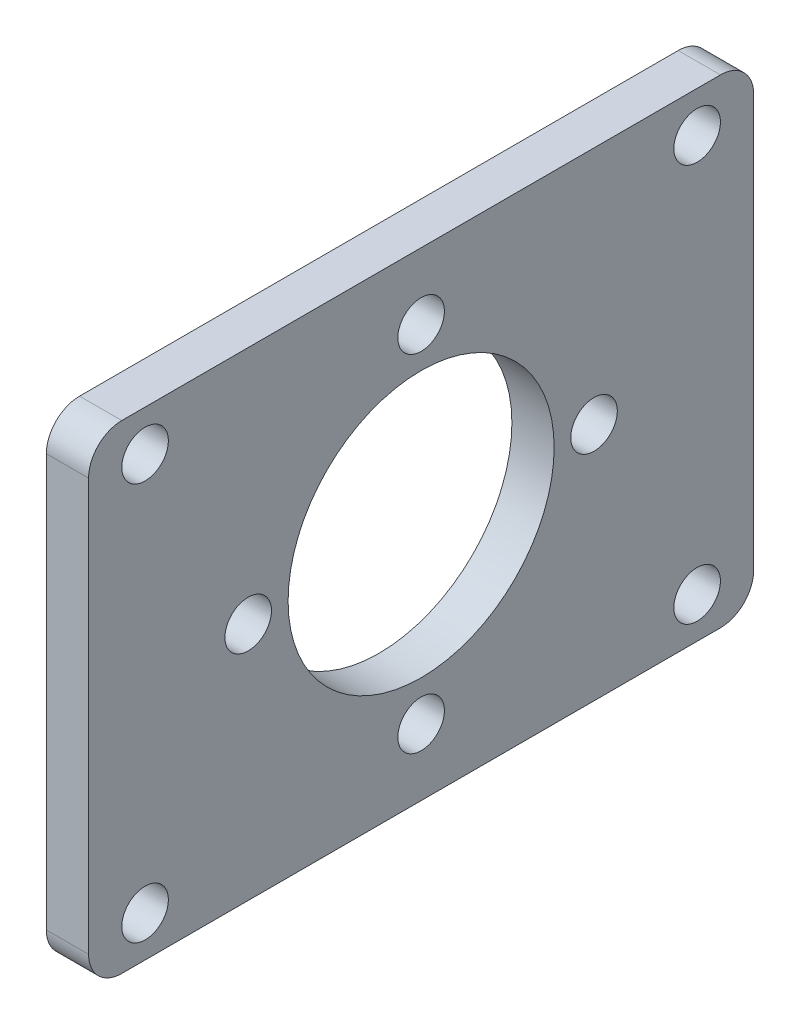
ISO-10303-21;
HEADER;
FILE_DESCRIPTION(('STEP AP214'),'2;1');
FILE_NAME('part.step','',(''),(''),'','','');
FILE_SCHEMA(('AUTOMOTIVE_DESIGN { 1 0 10303 214 1 1 1 1 }'));
ENDSEC;
DATA;
#1=APPLICATION_CONTEXT('core data for automotive mechanical design processes');
#2=APPLICATION_PROTOCOL_DEFINITION('international standard','automotive_design',2000,#1);
#3=PRODUCT_CONTEXT('',#1,'mechanical');
#4=PRODUCT('Part','Part','',(#3));
#5=PRODUCT_RELATED_PRODUCT_CATEGORY('part','',(#4));
#6=PRODUCT_DEFINITION_FORMATION('','',#4);
#7=PRODUCT_DEFINITION_CONTEXT('part definition',#1,'design');
#8=PRODUCT_DEFINITION('design','',#6,#7);
#9=PRODUCT_DEFINITION_SHAPE('','',#8);
#10=(LENGTH_UNIT() NAMED_UNIT(*) SI_UNIT(.MILLI.,.METRE.));
#11=(NAMED_UNIT(*) PLANE_ANGLE_UNIT() SI_UNIT($,.RADIAN.));
#12=(NAMED_UNIT(*) SI_UNIT($,.STERADIAN.) SOLID_ANGLE_UNIT());
#13=UNCERTAINTY_MEASURE_WITH_UNIT(LENGTH_MEASURE(1.E-05),#10,'distance_accuracy_value','');
#14=(GEOMETRIC_REPRESENTATION_CONTEXT(3) GLOBAL_UNCERTAINTY_ASSIGNED_CONTEXT((#13)) GLOBAL_UNIT_ASSIGNED_CONTEXT((#10,
#11,#12)) REPRESENTATION_CONTEXT('',''));
#15=CARTESIAN_POINT('',(0.,0.,0.));
#16=DIRECTION('',(0.,0.,1.));
#17=DIRECTION('',(1.,0.,0.));
#18=AXIS2_PLACEMENT_3D('',#15,#16,#17);
#19=CARTESIAN_POINT('',(3.175,-9.15,-16.9927524996676));
#20=DIRECTION('',(-1.,0.,0.));
#21=DIRECTION('',(0.,0.,1.));
#22=AXIS2_PLACEMENT_3D('',#19,#20,#21);
#23=PLANE('',#22);
#24=CARTESIAN_POINT('',(3.175,-9.15,-16.9927524996676));
#25=DIRECTION('',(1.,0.,0.));
#26=DIRECTION('',(0.,0.,1.));
#27=AXIS2_PLACEMENT_3D('',#24,#25,#26);
#28=CIRCLE('',#27,2.5);
#29=CARTESIAN_POINT('',(3.175,-9.15,-14.4927524996676));
#30=VERTEX_POINT('',#29);
#31=CARTESIAN_POINT('',(3.175,-11.65,-16.9927524996676));
#32=VERTEX_POINT('',#31);
#33=EDGE_CURVE('E151',#30,#32,#28,.T.);
#34=ORIENTED_EDGE('',*,*,#33,.T.);
#35=DIRECTION('',(0.,0.,-1.));
#36=VECTOR('',#35,1.);
#37=CARTESIAN_POINT('',(3.175,-11.65,-61.9927524996676));
#38=LINE('',#37,#36);
#39=CARTESIAN_POINT('',(3.175,-11.65,-61.9927524996676));
#40=VERTEX_POINT('',#39);
#41=EDGE_CURVE('E99',#32,#40,#38,.T.);
#42=ORIENTED_EDGE('',*,*,#41,.T.);
#43=CARTESIAN_POINT('',(3.175,-9.15,-61.9927524996676));
#44=DIRECTION('',(1.,0.,0.));
#45=DIRECTION('',(0.,0.,-1.));
#46=AXIS2_PLACEMENT_3D('',#43,#44,#45);
#47=CIRCLE('',#46,2.5);
#48=CARTESIAN_POINT('',(3.175,-9.15,-64.4927524996676));
#49=VERTEX_POINT('',#48);
#50=EDGE_CURVE('E166',#40,#49,#47,.T.);
#51=ORIENTED_EDGE('',*,*,#50,.T.);
#52=DIRECTION('',(0.,1.,0.));
#53=VECTOR('',#52,1.);
#54=CARTESIAN_POINT('',(3.175,-9.15,-64.4927524996676));
#55=LINE('',#54,#53);
#56=CARTESIAN_POINT('',(3.175,21.85,-64.4927524996676));
#57=VERTEX_POINT('',#56);
#58=EDGE_CURVE('E179',#49,#57,#55,.T.);
#59=ORIENTED_EDGE('',*,*,#58,.T.);
#60=CARTESIAN_POINT('',(3.175,21.85,-61.9927524996676));
#61=DIRECTION('',(1.,0.,0.));
#62=DIRECTION('',(0.,0.,-1.));
#63=AXIS2_PLACEMENT_3D('',#60,#61,#62);
#64=CIRCLE('',#63,2.5);
#65=CARTESIAN_POINT('',(3.175,24.35,-61.9927524996676));
#66=VERTEX_POINT('',#65);
#67=EDGE_CURVE('E118',#57,#66,#64,.T.);
#68=ORIENTED_EDGE('',*,*,#67,.T.);
#69=DIRECTION('',(0.,0.,1.));
#70=VECTOR('',#69,1.);
#71=CARTESIAN_POINT('',(3.175,24.35,-61.9927524996676));
#72=LINE('',#71,#70);
#73=CARTESIAN_POINT('',(3.175,24.35,-16.9927524996676));
#74=VERTEX_POINT('',#73);
#75=EDGE_CURVE('E112',#66,#74,#72,.T.);
#76=ORIENTED_EDGE('',*,*,#75,.T.);
#77=CARTESIAN_POINT('',(3.175,21.85,-16.9927524996676));
#78=DIRECTION('',(1.,0.,0.));
#79=DIRECTION('',(0.,0.,-1.));
#80=AXIS2_PLACEMENT_3D('',#77,#78,#79);
#81=CIRCLE('',#80,2.5);
#82=CARTESIAN_POINT('',(3.175,21.85,-14.4927524996676));
#83=VERTEX_POINT('',#82);
#84=EDGE_CURVE('E116',#74,#83,#81,.T.);
#85=ORIENTED_EDGE('',*,*,#84,.T.);
#86=DIRECTION('',(0.,-1.,0.));
#87=VECTOR('',#86,1.);
#88=CARTESIAN_POINT('',(3.175,-9.15,-14.4927524996676));
#89=LINE('',#88,#87);
#90=EDGE_CURVE('E56',#83,#30,#89,.T.);
#91=ORIENTED_EDGE('',*,*,#90,.T.);
#92=EDGE_LOOP('',(#34,#42,#51,#59,#68,#76,#85,#91));
#93=FACE_BOUND('',#92,.T.);
#94=CARTESIAN_POINT('',(3.175,21.29,-18.7427524996676));
#95=DIRECTION('',(1.,0.,0.));
#96=DIRECTION('',(0.,0.,-1.));
#97=AXIS2_PLACEMENT_3D('',#94,#95,#96);
#98=CIRCLE('',#97,1.75);
#99=CARTESIAN_POINT('',(3.175,21.29,-20.4927524996676));
#100=VERTEX_POINT('',#99);
#101=EDGE_CURVE('E140',#100,#100,#98,.T.);
#102=ORIENTED_EDGE('',*,*,#101,.F.);
#103=EDGE_LOOP('',(#102));
#104=FACE_BOUND('',#103,.T.);
#105=CARTESIAN_POINT('',(3.175,-8.59,-18.7427524996676));
#106=DIRECTION('',(1.,0.,0.));
#107=DIRECTION('',(0.,0.,-1.));
#108=AXIS2_PLACEMENT_3D('',#105,#106,#107);
#109=CIRCLE('',#108,1.75);
#110=CARTESIAN_POINT('',(3.175,-8.59,-20.4927524996676));
#111=VERTEX_POINT('',#110);
#112=EDGE_CURVE('E188',#111,#111,#109,.T.);
#113=ORIENTED_EDGE('',*,*,#112,.F.);
#114=EDGE_LOOP('',(#113));
#115=FACE_BOUND('',#114,.T.);
#116=CARTESIAN_POINT('',(3.175,21.29,-60.2427524996676));
#117=DIRECTION('',(1.,0.,0.));
#118=DIRECTION('',(0.,0.,-1.));
#119=AXIS2_PLACEMENT_3D('',#116,#117,#118);
#120=CIRCLE('',#119,1.75);
#121=CARTESIAN_POINT('',(3.175,21.29,-61.9927524996676));
#122=VERTEX_POINT('',#121);
#123=EDGE_CURVE('E194',#122,#122,#120,.T.);
#124=ORIENTED_EDGE('',*,*,#123,.F.);
#125=EDGE_LOOP('',(#124));
#126=FACE_BOUND('',#125,.T.);
#127=CARTESIAN_POINT('',(3.175,-8.59,-60.2427524996676));
#128=DIRECTION('',(1.,0.,0.));
#129=DIRECTION('',(0.,0.,-1.));
#130=AXIS2_PLACEMENT_3D('',#127,#128,#129);
#131=CIRCLE('',#130,1.75);
#132=CARTESIAN_POINT('',(3.175,-8.59,-61.9927524996676));
#133=VERTEX_POINT('',#132);
#134=EDGE_CURVE('E200',#133,#133,#131,.T.);
#135=ORIENTED_EDGE('',*,*,#134,.F.);
#136=EDGE_LOOP('',(#135));
#137=FACE_BOUND('',#136,.T.);
#138=CARTESIAN_POINT('',(3.175,6.35,-39.4927524996676));
#139=DIRECTION('',(1.,0.,0.));
#140=DIRECTION('',(0.,0.,-1.));
#141=AXIS2_PLACEMENT_3D('',#138,#139,#140);
#142=CIRCLE('',#141,10.);
#143=CARTESIAN_POINT('',(3.175,6.35,-49.4927524996676));
#144=VERTEX_POINT('',#143);
#145=EDGE_CURVE('E206',#144,#144,#142,.T.);
#146=ORIENTED_EDGE('',*,*,#145,.F.);
#147=EDGE_LOOP('',(#146));
#148=FACE_BOUND('',#147,.T.);
#149=CARTESIAN_POINT('',(3.175,6.35,-26.4927524996676));
#150=DIRECTION('',(1.,0.,0.));
#151=DIRECTION('',(0.,0.,-1.));
#152=AXIS2_PLACEMENT_3D('',#149,#150,#151);
#153=CIRCLE('',#152,1.75);
#154=CARTESIAN_POINT('',(3.175,6.35,-28.2427524996676));
#155=VERTEX_POINT('',#154);
#156=EDGE_CURVE('E212',#155,#155,#153,.T.);
#157=ORIENTED_EDGE('',*,*,#156,.F.);
#158=EDGE_LOOP('',(#157));
#159=FACE_BOUND('',#158,.T.);
#160=CARTESIAN_POINT('',(3.175,19.35,-39.4927524996676));
#161=DIRECTION('',(1.,0.,0.));
#162=DIRECTION('',(0.,0.,-1.));
#163=AXIS2_PLACEMENT_3D('',#160,#161,#162);
#164=CIRCLE('',#163,1.75);
#165=CARTESIAN_POINT('',(3.175,19.35,-41.2427524996676));
#166=VERTEX_POINT('',#165);
#167=EDGE_CURVE('E218',#166,#166,#164,.T.);
#168=ORIENTED_EDGE('',*,*,#167,.F.);
#169=EDGE_LOOP('',(#168));
#170=FACE_BOUND('',#169,.T.);
#171=CARTESIAN_POINT('',(3.175,6.35000000000002,-52.4927524996676));
#172=DIRECTION('',(1.,0.,0.));
#173=DIRECTION('',(0.,0.,-1.));
#174=AXIS2_PLACEMENT_3D('',#171,#172,#173);
#175=CIRCLE('',#174,1.75);
#176=CARTESIAN_POINT('',(3.175,6.35000000000002,-54.2427524996676));
#177=VERTEX_POINT('',#176);
#178=EDGE_CURVE('E224',#177,#177,#175,.T.);
#179=ORIENTED_EDGE('',*,*,#178,.F.);
#180=EDGE_LOOP('',(#179));
#181=FACE_BOUND('',#180,.T.);
#182=CARTESIAN_POINT('',(3.175,-6.65,-39.4927524996676));
#183=DIRECTION('',(1.,0.,0.));
#184=DIRECTION('',(0.,0.,-1.));
#185=AXIS2_PLACEMENT_3D('',#182,#183,#184);
#186=CIRCLE('',#185,1.75);
#187=CARTESIAN_POINT('',(3.175,-6.65,-41.2427524996676));
#188=VERTEX_POINT('',#187);
#189=EDGE_CURVE('E230',#188,#188,#186,.T.);
#190=ORIENTED_EDGE('',*,*,#189,.F.);
#191=EDGE_LOOP('',(#190));
#192=FACE_BOUND('',#191,.T.);
#193=ADVANCED_FACE('F39',(#93,#104,#115,#126,#137,#148,#159,#170,#181,#192),#23,.F.);
#194=CARTESIAN_POINT('',(0.,-9.15,-16.9927524996676));
#195=DIRECTION('',(-1.,0.,0.));
#196=DIRECTION('',(0.,0.,1.));
#197=AXIS2_PLACEMENT_3D('',#194,#195,#196);
#198=PLANE('',#197);
#199=CARTESIAN_POINT('',(0.,6.35000000000002,-52.4927524996676));
#200=DIRECTION('',(1.,0.,0.));
#201=DIRECTION('',(0.,0.,-1.));
#202=AXIS2_PLACEMENT_3D('',#199,#200,#201);
#203=CIRCLE('',#202,1.75);
#204=CARTESIAN_POINT('',(0.,6.35000000000002,-54.2427524996676));
#205=VERTEX_POINT('',#204);
#206=EDGE_CURVE('E227',#205,#205,#203,.T.);
#207=ORIENTED_EDGE('',*,*,#206,.T.);
#208=EDGE_LOOP('',(#207));
#209=FACE_BOUND('',#208,.T.);
#210=CARTESIAN_POINT('',(0.,6.35,-26.4927524996676));
#211=DIRECTION('',(1.,0.,0.));
#212=DIRECTION('',(0.,0.,-1.));
#213=AXIS2_PLACEMENT_3D('',#210,#211,#212);
#214=CIRCLE('',#213,1.75);
#215=CARTESIAN_POINT('',(0.,6.35,-28.2427524996676));
#216=VERTEX_POINT('',#215);
#217=EDGE_CURVE('E215',#216,#216,#214,.T.);
#218=ORIENTED_EDGE('',*,*,#217,.T.);
#219=EDGE_LOOP('',(#218));
#220=FACE_BOUND('',#219,.T.);
#221=CARTESIAN_POINT('',(0.,-8.59,-60.2427524996676));
#222=DIRECTION('',(1.,0.,0.));
#223=DIRECTION('',(0.,0.,-1.));
#224=AXIS2_PLACEMENT_3D('',#221,#222,#223);
#225=CIRCLE('',#224,1.75);
#226=CARTESIAN_POINT('',(0.,-8.59,-61.9927524996676));
#227=VERTEX_POINT('',#226);
#228=EDGE_CURVE('E203',#227,#227,#225,.T.);
#229=ORIENTED_EDGE('',*,*,#228,.T.);
#230=EDGE_LOOP('',(#229));
#231=FACE_BOUND('',#230,.T.);
#232=CARTESIAN_POINT('',(0.,-8.59,-18.7427524996676));
#233=DIRECTION('',(1.,0.,0.));
#234=DIRECTION('',(0.,0.,-1.));
#235=AXIS2_PLACEMENT_3D('',#232,#233,#234);
#236=CIRCLE('',#235,1.75);
#237=CARTESIAN_POINT('',(0.,-8.59,-20.4927524996676));
#238=VERTEX_POINT('',#237);
#239=EDGE_CURVE('E191',#238,#238,#236,.T.);
#240=ORIENTED_EDGE('',*,*,#239,.T.);
#241=EDGE_LOOP('',(#240));
#242=FACE_BOUND('',#241,.T.);
#243=CARTESIAN_POINT('',(0.,-9.15,-16.9927524996676));
#244=DIRECTION('',(1.,0.,0.));
#245=DIRECTION('',(0.,0.,1.));
#246=AXIS2_PLACEMENT_3D('',#243,#244,#245);
#247=CIRCLE('',#246,2.5);
#248=CARTESIAN_POINT('',(0.,-9.15,-14.4927524996676));
#249=VERTEX_POINT('',#248);
#250=CARTESIAN_POINT('',(0.,-11.65,-16.9927524996676));
#251=VERTEX_POINT('',#250);
#252=EDGE_CURVE('E136',#249,#251,#247,.T.);
#253=ORIENTED_EDGE('',*,*,#252,.F.);
#254=DIRECTION('',(0.,-1.,0.));
#255=VECTOR('',#254,1.);
#256=CARTESIAN_POINT('',(0.,-9.15,-14.4927524996676));
#257=LINE('',#256,#255);
#258=CARTESIAN_POINT('',(0.,21.85,-14.4927524996676));
#259=VERTEX_POINT('',#258);
#260=EDGE_CURVE('E91',#259,#249,#257,.T.);
#261=ORIENTED_EDGE('',*,*,#260,.F.);
#262=CARTESIAN_POINT('',(0.,21.85,-16.9927524996676));
#263=DIRECTION('',(1.,0.,0.));
#264=DIRECTION('',(0.,0.,-1.));
#265=AXIS2_PLACEMENT_3D('',#262,#263,#264);
#266=CIRCLE('',#265,2.5);
#267=CARTESIAN_POINT('',(0.,24.35,-16.9927524996676));
#268=VERTEX_POINT('',#267);
#269=EDGE_CURVE('E85',#268,#259,#266,.T.);
#270=ORIENTED_EDGE('',*,*,#269,.F.);
#271=DIRECTION('',(0.,0.,1.));
#272=VECTOR('',#271,1.);
#273=CARTESIAN_POINT('',(0.,24.35,-61.9927524996676));
#274=LINE('',#273,#272);
#275=CARTESIAN_POINT('',(0.,24.35,-61.9927524996676));
#276=VERTEX_POINT('',#275);
#277=EDGE_CURVE('E126',#276,#268,#274,.T.);
#278=ORIENTED_EDGE('',*,*,#277,.F.);
#279=CARTESIAN_POINT('',(0.,21.85,-61.9927524996676));
#280=DIRECTION('',(1.,0.,0.));
#281=DIRECTION('',(0.,0.,-1.));
#282=AXIS2_PLACEMENT_3D('',#279,#280,#281);
#283=CIRCLE('',#282,2.5);
#284=CARTESIAN_POINT('',(0.,21.85,-64.4927524996676));
#285=VERTEX_POINT('',#284);
#286=EDGE_CURVE('E146',#285,#276,#283,.T.);
#287=ORIENTED_EDGE('',*,*,#286,.F.);
#288=DIRECTION('',(0.,1.,0.));
#289=VECTOR('',#288,1.);
#290=CARTESIAN_POINT('',(0.,-9.15,-64.4927524996676));
#291=LINE('',#290,#289);
#292=CARTESIAN_POINT('',(0.,-9.15,-64.4927524996676));
#293=VERTEX_POINT('',#292);
#294=EDGE_CURVE('E144',#293,#285,#291,.T.);
#295=ORIENTED_EDGE('',*,*,#294,.F.);
#296=CARTESIAN_POINT('',(0.,-9.15,-61.9927524996676));
#297=DIRECTION('',(1.,0.,0.));
#298=DIRECTION('',(0.,0.,-1.));
#299=AXIS2_PLACEMENT_3D('',#296,#297,#298);
#300=CIRCLE('',#299,2.5);
#301=CARTESIAN_POINT('',(0.,-11.65,-61.9927524996676));
#302=VERTEX_POINT('',#301);
#303=EDGE_CURVE('E142',#302,#293,#300,.T.);
#304=ORIENTED_EDGE('',*,*,#303,.F.);
#305=DIRECTION('',(0.,0.,-1.));
#306=VECTOR('',#305,1.);
#307=CARTESIAN_POINT('',(0.,-11.65,-61.9927524996676));
#308=LINE('',#307,#306);
#309=EDGE_CURVE('E139',#251,#302,#308,.T.);
#310=ORIENTED_EDGE('',*,*,#309,.F.);
#311=EDGE_LOOP('',(#253,#261,#270,#278,#287,#295,#304,#310));
#312=FACE_BOUND('',#311,.T.);
#313=CARTESIAN_POINT('',(0.,21.29,-18.7427524996676));
#314=DIRECTION('',(1.,0.,0.));
#315=DIRECTION('',(0.,0.,-1.));
#316=AXIS2_PLACEMENT_3D('',#313,#314,#315);
#317=CIRCLE('',#316,1.75);
#318=CARTESIAN_POINT('',(0.,21.29,-20.4927524996676));
#319=VERTEX_POINT('',#318);
#320=EDGE_CURVE('E185',#319,#319,#317,.T.);
#321=ORIENTED_EDGE('',*,*,#320,.T.);
#322=EDGE_LOOP('',(#321));
#323=FACE_BOUND('',#322,.T.);
#324=CARTESIAN_POINT('',(0.,21.29,-60.2427524996676));
#325=DIRECTION('',(1.,0.,0.));
#326=DIRECTION('',(0.,0.,-1.));
#327=AXIS2_PLACEMENT_3D('',#324,#325,#326);
#328=CIRCLE('',#327,1.75);
#329=CARTESIAN_POINT('',(0.,21.29,-61.9927524996676));
#330=VERTEX_POINT('',#329);
#331=EDGE_CURVE('E197',#330,#330,#328,.T.);
#332=ORIENTED_EDGE('',*,*,#331,.T.);
#333=EDGE_LOOP('',(#332));
#334=FACE_BOUND('',#333,.T.);
#335=CARTESIAN_POINT('',(0.,6.35,-39.4927524996676));
#336=DIRECTION('',(1.,0.,0.));
#337=DIRECTION('',(0.,0.,-1.));
#338=AXIS2_PLACEMENT_3D('',#335,#336,#337);
#339=CIRCLE('',#338,10.);
#340=CARTESIAN_POINT('',(0.,6.35,-49.4927524996676));
#341=VERTEX_POINT('',#340);
#342=EDGE_CURVE('E209',#341,#341,#339,.T.);
#343=ORIENTED_EDGE('',*,*,#342,.T.);
#344=EDGE_LOOP('',(#343));
#345=FACE_BOUND('',#344,.T.);
#346=CARTESIAN_POINT('',(0.,19.35,-39.4927524996676));
#347=DIRECTION('',(1.,0.,0.));
#348=DIRECTION('',(0.,0.,-1.));
#349=AXIS2_PLACEMENT_3D('',#346,#347,#348);
#350=CIRCLE('',#349,1.75);
#351=CARTESIAN_POINT('',(0.,19.35,-41.2427524996676));
#352=VERTEX_POINT('',#351);
#353=EDGE_CURVE('E221',#352,#352,#350,.T.);
#354=ORIENTED_EDGE('',*,*,#353,.T.);
#355=EDGE_LOOP('',(#354));
#356=FACE_BOUND('',#355,.T.);
#357=CARTESIAN_POINT('',(0.,-6.65,-39.4927524996676));
#358=DIRECTION('',(1.,0.,0.));
#359=DIRECTION('',(0.,0.,-1.));
#360=AXIS2_PLACEMENT_3D('',#357,#358,#359);
#361=CIRCLE('',#360,1.75);
#362=CARTESIAN_POINT('',(0.,-6.65,-41.2427524996676));
#363=VERTEX_POINT('',#362);
#364=EDGE_CURVE('E233',#363,#363,#361,.T.);
#365=ORIENTED_EDGE('',*,*,#364,.T.);
#366=EDGE_LOOP('',(#365));
#367=FACE_BOUND('',#366,.T.);
#368=ADVANCED_FACE('F170',(#209,#220,#231,#242,#312,#323,#334,#345,#356,#367),#198,.T.);
#369=CARTESIAN_POINT('',(3.175,-9.15,-16.9927524996676));
#370=DIRECTION('',(-1.,0.,0.));
#371=DIRECTION('',(0.,0.,1.));
#372=AXIS2_PLACEMENT_3D('',#369,#370,#371);
#373=CYLINDRICAL_SURFACE('',#372,2.5);
#374=ORIENTED_EDGE('',*,*,#252,.T.);
#375=DIRECTION('',(-1.,0.,0.));
#376=VECTOR('',#375,1.);
#377=CARTESIAN_POINT('',(3.175,-11.65,-16.9927524996676));
#378=LINE('',#377,#376);
#379=EDGE_CURVE('E11',#32,#251,#378,.T.);
#380=ORIENTED_EDGE('',*,*,#379,.F.);
#381=ORIENTED_EDGE('',*,*,#33,.F.);
#382=DIRECTION('',(-1.,0.,0.));
#383=VECTOR('',#382,1.);
#384=CARTESIAN_POINT('',(3.175,-9.15,-14.4927524996676));
#385=LINE('',#384,#383);
#386=EDGE_CURVE('E132',#30,#249,#385,.T.);
#387=ORIENTED_EDGE('',*,*,#386,.T.);
#388=EDGE_LOOP('',(#374,#380,#381,#387));
#389=FACE_BOUND('',#388,.T.);
#390=ADVANCED_FACE('F41',(#389),#373,.T.);
#391=CARTESIAN_POINT('',(3.175,-11.65,-61.9927524996676));
#392=DIRECTION('',(0.,1.,0.));
#393=DIRECTION('',(0.,0.,1.));
#394=AXIS2_PLACEMENT_3D('',#391,#392,#393);
#395=PLANE('',#394);
#396=ORIENTED_EDGE('',*,*,#309,.T.);
#397=DIRECTION('',(-1.,0.,0.));
#398=VECTOR('',#397,1.);
#399=CARTESIAN_POINT('',(3.175,-11.65,-61.9927524996676));
#400=LINE('',#399,#398);
#401=EDGE_CURVE('E48',#40,#302,#400,.T.);
#402=ORIENTED_EDGE('',*,*,#401,.F.);
#403=ORIENTED_EDGE('',*,*,#41,.F.);
#404=ORIENTED_EDGE('',*,*,#379,.T.);
#405=EDGE_LOOP('',(#396,#402,#403,#404));
#406=FACE_BOUND('',#405,.T.);
#407=ADVANCED_FACE('F265',(#406),#395,.F.);
#408=CARTESIAN_POINT('',(3.175,-9.15,-61.9927524996676));
#409=DIRECTION('',(-1.,0.,0.));
#410=DIRECTION('',(0.,0.,1.));
#411=AXIS2_PLACEMENT_3D('',#408,#409,#410);
#412=CYLINDRICAL_SURFACE('',#411,2.5);
#413=ORIENTED_EDGE('',*,*,#303,.T.);
#414=DIRECTION('',(-1.,0.,0.));
#415=VECTOR('',#414,1.);
#416=CARTESIAN_POINT('',(3.175,-9.15,-64.4927524996676));
#417=LINE('',#416,#415);
#418=EDGE_CURVE('E158',#49,#293,#417,.T.);
#419=ORIENTED_EDGE('',*,*,#418,.F.);
#420=ORIENTED_EDGE('',*,*,#50,.F.);
#421=ORIENTED_EDGE('',*,*,#401,.T.);
#422=EDGE_LOOP('',(#413,#419,#420,#421));
#423=FACE_BOUND('',#422,.T.);
#424=ADVANCED_FACE('F164',(#423),#412,.T.);
#425=CARTESIAN_POINT('',(3.175,-9.15,-64.4927524996676));
#426=DIRECTION('',(0.,0.,1.));
#427=DIRECTION('',(1.,0.,0.));
#428=AXIS2_PLACEMENT_3D('',#425,#426,#427);
#429=PLANE('',#428);
#430=ORIENTED_EDGE('',*,*,#294,.T.);
#431=DIRECTION('',(-1.,0.,0.));
#432=VECTOR('',#431,1.);
#433=CARTESIAN_POINT('',(3.175,21.85,-64.4927524996676));
#434=LINE('',#433,#432);
#435=EDGE_CURVE('E155',#57,#285,#434,.T.);
#436=ORIENTED_EDGE('',*,*,#435,.F.);
#437=ORIENTED_EDGE('',*,*,#58,.F.);
#438=ORIENTED_EDGE('',*,*,#418,.T.);
#439=EDGE_LOOP('',(#430,#436,#437,#438));
#440=FACE_BOUND('',#439,.T.);
#441=ADVANCED_FACE('F175',(#440),#429,.F.);
#442=CARTESIAN_POINT('',(3.175,21.85,-61.9927524996676));
#443=DIRECTION('',(-1.,0.,0.));
#444=DIRECTION('',(0.,0.,1.));
#445=AXIS2_PLACEMENT_3D('',#442,#443,#444);
#446=CYLINDRICAL_SURFACE('',#445,2.5);
#447=ORIENTED_EDGE('',*,*,#286,.T.);
#448=DIRECTION('',(-1.,0.,0.));
#449=VECTOR('',#448,1.);
#450=CARTESIAN_POINT('',(3.175,24.35,-61.9927524996676));
#451=LINE('',#450,#449);
#452=EDGE_CURVE('E127',#66,#276,#451,.T.);
#453=ORIENTED_EDGE('',*,*,#452,.F.);
#454=ORIENTED_EDGE('',*,*,#67,.F.);
#455=ORIENTED_EDGE('',*,*,#435,.T.);
#456=EDGE_LOOP('',(#447,#453,#454,#455));
#457=FACE_BOUND('',#456,.T.);
#458=ADVANCED_FACE('F178',(#457),#446,.T.);
#459=CARTESIAN_POINT('',(3.175,24.35,-61.9927524996676));
#460=DIRECTION('',(0.,-1.,0.));
#461=DIRECTION('',(0.,0.,-1.));
#462=AXIS2_PLACEMENT_3D('',#459,#460,#461);
#463=PLANE('',#462);
#464=ORIENTED_EDGE('',*,*,#277,.T.);
#465=DIRECTION('',(-1.,0.,0.));
#466=VECTOR('',#465,1.);
#467=CARTESIAN_POINT('',(3.175,24.35,-16.9927524996676));
#468=LINE('',#467,#466);
#469=EDGE_CURVE('E123',#74,#268,#468,.T.);
#470=ORIENTED_EDGE('',*,*,#469,.F.);
#471=ORIENTED_EDGE('',*,*,#75,.F.);
#472=ORIENTED_EDGE('',*,*,#452,.T.);
#473=EDGE_LOOP('',(#464,#470,#471,#472));
#474=FACE_BOUND('',#473,.T.);
#475=ADVANCED_FACE('F124',(#474),#463,.F.);
#476=CARTESIAN_POINT('',(3.175,21.85,-16.9927524996676));
#477=DIRECTION('',(-1.,0.,0.));
#478=DIRECTION('',(0.,0.,1.));
#479=AXIS2_PLACEMENT_3D('',#476,#477,#478);
#480=CYLINDRICAL_SURFACE('',#479,2.5);
#481=ORIENTED_EDGE('',*,*,#269,.T.);
#482=DIRECTION('',(-1.,0.,0.));
#483=VECTOR('',#482,1.);
#484=CARTESIAN_POINT('',(3.175,21.85,-14.4927524996676));
#485=LINE('',#484,#483);
#486=EDGE_CURVE('E128',#83,#259,#485,.T.);
#487=ORIENTED_EDGE('',*,*,#486,.F.);
#488=ORIENTED_EDGE('',*,*,#84,.F.);
#489=ORIENTED_EDGE('',*,*,#469,.T.);
#490=EDGE_LOOP('',(#481,#487,#488,#489));
#491=FACE_BOUND('',#490,.T.);
#492=ADVANCED_FACE('F130',(#491),#480,.T.);
#493=CARTESIAN_POINT('',(3.175,-9.15,-14.4927524996676));
#494=DIRECTION('',(0.,0.,-1.));
#495=DIRECTION('',(0.,1.,0.));
#496=AXIS2_PLACEMENT_3D('',#493,#494,#495);
#497=PLANE('',#496);
#498=ORIENTED_EDGE('',*,*,#260,.T.);
#499=ORIENTED_EDGE('',*,*,#386,.F.);
#500=ORIENTED_EDGE('',*,*,#90,.F.);
#501=ORIENTED_EDGE('',*,*,#486,.T.);
#502=EDGE_LOOP('',(#498,#499,#500,#501));
#503=FACE_BOUND('',#502,.T.);
#504=ADVANCED_FACE('F253',(#503),#497,.F.);
#505=CARTESIAN_POINT('',(3.175,21.29,-18.7427524996676));
#506=DIRECTION('',(-1.,0.,0.));
#507=DIRECTION('',(0.,0.,1.));
#508=AXIS2_PLACEMENT_3D('',#505,#506,#507);
#509=CYLINDRICAL_SURFACE('',#508,1.75);
#510=ORIENTED_EDGE('',*,*,#101,.T.);
#511=EDGE_LOOP('',(#510));
#512=FACE_BOUND('',#511,.T.);
#513=ORIENTED_EDGE('',*,*,#320,.F.);
#514=EDGE_LOOP('',(#513));
#515=FACE_BOUND('',#514,.T.);
#516=ADVANCED_FACE('F250',(#512,#515),#509,.F.);
#517=CARTESIAN_POINT('',(3.175,-8.59,-18.7427524996676));
#518=DIRECTION('',(-1.,0.,0.));
#519=DIRECTION('',(0.,0.,1.));
#520=AXIS2_PLACEMENT_3D('',#517,#518,#519);
#521=CYLINDRICAL_SURFACE('',#520,1.75);
#522=ORIENTED_EDGE('',*,*,#112,.T.);
#523=EDGE_LOOP('',(#522));
#524=FACE_BOUND('',#523,.T.);
#525=ORIENTED_EDGE('',*,*,#239,.F.);
#526=EDGE_LOOP('',(#525));
#527=FACE_BOUND('',#526,.T.);
#528=ADVANCED_FACE('F328',(#524,#527),#521,.F.);
#529=CARTESIAN_POINT('',(3.175,21.29,-60.2427524996676));
#530=DIRECTION('',(-1.,0.,0.));
#531=DIRECTION('',(0.,0.,1.));
#532=AXIS2_PLACEMENT_3D('',#529,#530,#531);
#533=CYLINDRICAL_SURFACE('',#532,1.75);
#534=ORIENTED_EDGE('',*,*,#123,.T.);
#535=EDGE_LOOP('',(#534));
#536=FACE_BOUND('',#535,.T.);
#537=ORIENTED_EDGE('',*,*,#331,.F.);
#538=EDGE_LOOP('',(#537));
#539=FACE_BOUND('',#538,.T.);
#540=ADVANCED_FACE('F336',(#536,#539),#533,.F.);
#541=CARTESIAN_POINT('',(3.175,-8.59,-60.2427524996676));
#542=DIRECTION('',(-1.,0.,0.));
#543=DIRECTION('',(0.,0.,1.));
#544=AXIS2_PLACEMENT_3D('',#541,#542,#543);
#545=CYLINDRICAL_SURFACE('',#544,1.75);
#546=ORIENTED_EDGE('',*,*,#134,.T.);
#547=EDGE_LOOP('',(#546));
#548=FACE_BOUND('',#547,.T.);
#549=ORIENTED_EDGE('',*,*,#228,.F.);
#550=EDGE_LOOP('',(#549));
#551=FACE_BOUND('',#550,.T.);
#552=ADVANCED_FACE('F344',(#548,#551),#545,.F.);
#553=CARTESIAN_POINT('',(3.175,6.35,-39.4927524996676));
#554=DIRECTION('',(-1.,0.,0.));
#555=DIRECTION('',(0.,0.,1.));
#556=AXIS2_PLACEMENT_3D('',#553,#554,#555);
#557=CYLINDRICAL_SURFACE('',#556,10.);
#558=ORIENTED_EDGE('',*,*,#145,.T.);
#559=EDGE_LOOP('',(#558));
#560=FACE_BOUND('',#559,.T.);
#561=ORIENTED_EDGE('',*,*,#342,.F.);
#562=EDGE_LOOP('',(#561));
#563=FACE_BOUND('',#562,.T.);
#564=ADVANCED_FACE('F353',(#560,#563),#557,.F.);
#565=CARTESIAN_POINT('',(3.175,6.35,-26.4927524996676));
#566=DIRECTION('',(-1.,0.,0.));
#567=DIRECTION('',(0.,0.,1.));
#568=AXIS2_PLACEMENT_3D('',#565,#566,#567);
#569=CYLINDRICAL_SURFACE('',#568,1.75);
#570=ORIENTED_EDGE('',*,*,#156,.T.);
#571=EDGE_LOOP('',(#570));
#572=FACE_BOUND('',#571,.T.);
#573=ORIENTED_EDGE('',*,*,#217,.F.);
#574=EDGE_LOOP('',(#573));
#575=FACE_BOUND('',#574,.T.);
#576=ADVANCED_FACE('F362',(#572,#575),#569,.F.);
#577=CARTESIAN_POINT('',(3.175,19.35,-39.4927524996676));
#578=DIRECTION('',(-1.,0.,0.));
#579=DIRECTION('',(0.,0.,1.));
#580=AXIS2_PLACEMENT_3D('',#577,#578,#579);
#581=CYLINDRICAL_SURFACE('',#580,1.75);
#582=ORIENTED_EDGE('',*,*,#167,.T.);
#583=EDGE_LOOP('',(#582));
#584=FACE_BOUND('',#583,.T.);
#585=ORIENTED_EDGE('',*,*,#353,.F.);
#586=EDGE_LOOP('',(#585));
#587=FACE_BOUND('',#586,.T.);
#588=ADVANCED_FACE('F371',(#584,#587),#581,.F.);
#589=CARTESIAN_POINT('',(3.175,6.35000000000002,-52.4927524996676));
#590=DIRECTION('',(-1.,0.,0.));
#591=DIRECTION('',(0.,0.,1.));
#592=AXIS2_PLACEMENT_3D('',#589,#590,#591);
#593=CYLINDRICAL_SURFACE('',#592,1.75);
#594=ORIENTED_EDGE('',*,*,#178,.T.);
#595=EDGE_LOOP('',(#594));
#596=FACE_BOUND('',#595,.T.);
#597=ORIENTED_EDGE('',*,*,#206,.F.);
#598=EDGE_LOOP('',(#597));
#599=FACE_BOUND('',#598,.T.);
#600=ADVANCED_FACE('F380',(#596,#599),#593,.F.);
#601=CARTESIAN_POINT('',(3.175,-6.65,-39.4927524996676));
#602=DIRECTION('',(-1.,0.,0.));
#603=DIRECTION('',(0.,0.,1.));
#604=AXIS2_PLACEMENT_3D('',#601,#602,#603);
#605=CYLINDRICAL_SURFACE('',#604,1.75);
#606=ORIENTED_EDGE('',*,*,#189,.T.);
#607=EDGE_LOOP('',(#606));
#608=FACE_BOUND('',#607,.T.);
#609=ORIENTED_EDGE('',*,*,#364,.F.);
#610=EDGE_LOOP('',(#609));
#611=FACE_BOUND('',#610,.T.);
#612=ADVANCED_FACE('F239',(#608,#611),#605,.F.);
#613=CLOSED_SHELL('',(#193,#368,#390,#407,#424,#441,#458,#475,#492,#504,#516,#528,#540,#552,
#564,#576,#588,#600,#612));
#614=MANIFOLD_SOLID_BREP('B2',#613);
#615=ADVANCED_BREP_SHAPE_REPRESENTATION('',(#18,#614),#14);
#616=SHAPE_DEFINITION_REPRESENTATION(#9,#615);
ENDSEC;
END-ISO-10303-21;
